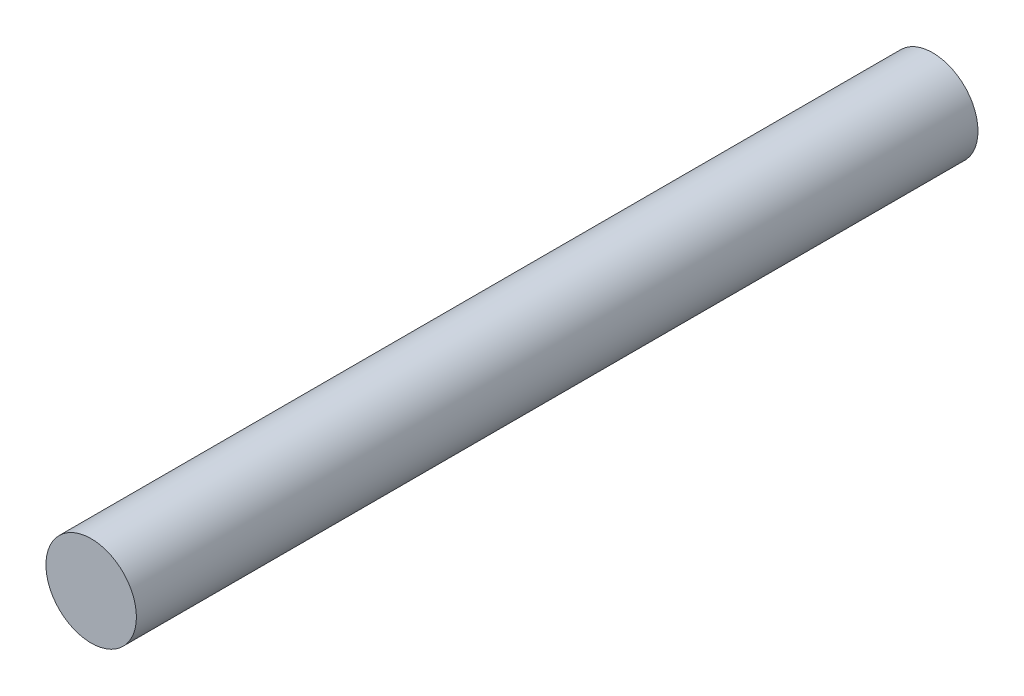
ISO-10303-21;
HEADER;
FILE_DESCRIPTION(('STEP AP214'),'2;1');
FILE_NAME('part.step','',(''),(''),'','','');
FILE_SCHEMA(('AUTOMOTIVE_DESIGN { 1 0 10303 214 1 1 1 1 }'));
ENDSEC;
DATA;
#1=APPLICATION_CONTEXT('core data for automotive mechanical design processes');
#2=APPLICATION_PROTOCOL_DEFINITION('international standard','automotive_design',2000,#1);
#3=PRODUCT_CONTEXT('',#1,'mechanical');
#4=PRODUCT('Part','Part','',(#3));
#5=PRODUCT_RELATED_PRODUCT_CATEGORY('part','',(#4));
#6=PRODUCT_DEFINITION_FORMATION('','',#4);
#7=PRODUCT_DEFINITION_CONTEXT('part definition',#1,'design');
#8=PRODUCT_DEFINITION('design','',#6,#7);
#9=PRODUCT_DEFINITION_SHAPE('','',#8);
#10=(LENGTH_UNIT() NAMED_UNIT(*) SI_UNIT(.MILLI.,.METRE.));
#11=(NAMED_UNIT(*) PLANE_ANGLE_UNIT() SI_UNIT($,.RADIAN.));
#12=(NAMED_UNIT(*) SI_UNIT($,.STERADIAN.) SOLID_ANGLE_UNIT());
#13=UNCERTAINTY_MEASURE_WITH_UNIT(LENGTH_MEASURE(1.E-05),#10,'distance_accuracy_value','');
#14=(GEOMETRIC_REPRESENTATION_CONTEXT(3) GLOBAL_UNCERTAINTY_ASSIGNED_CONTEXT((#13)) GLOBAL_UNIT_ASSIGNED_CONTEXT((#10,
#11,#12)) REPRESENTATION_CONTEXT('',''));
#15=CARTESIAN_POINT('',(0.,0.,0.));
#16=DIRECTION('',(0.,0.,1.));
#17=DIRECTION('',(1.,0.,0.));
#18=AXIS2_PLACEMENT_3D('',#15,#16,#17);
#19=CARTESIAN_POINT('',(0.,0.,46.5));
#20=DIRECTION('',(0.,0.,-1.));
#21=DIRECTION('',(-1.,0.,0.));
#22=AXIS2_PLACEMENT_3D('',#19,#20,#21);
#23=CYLINDRICAL_SURFACE('',#22,2.5);
#24=CARTESIAN_POINT('',(0.,0.,46.5));
#25=DIRECTION('',(0.,0.,1.));
#26=DIRECTION('',(1.,0.,0.));
#27=AXIS2_PLACEMENT_3D('',#24,#25,#26);
#28=CIRCLE('',#27,2.5);
#29=CARTESIAN_POINT('',(2.5,0.,46.5));
#30=VERTEX_POINT('',#29);
#31=EDGE_CURVE('E10',#30,#30,#28,.T.);
#32=ORIENTED_EDGE('',*,*,#31,.F.);
#33=EDGE_LOOP('',(#32));
#34=FACE_BOUND('',#33,.T.);
#35=CARTESIAN_POINT('',(0.,0.,0.));
#36=DIRECTION('',(0.,0.,1.));
#37=DIRECTION('',(1.,0.,0.));
#38=AXIS2_PLACEMENT_3D('',#35,#36,#37);
#39=CIRCLE('',#38,2.5);
#40=CARTESIAN_POINT('',(2.5,0.,0.));
#41=VERTEX_POINT('',#40);
#42=EDGE_CURVE('E44',#41,#41,#39,.T.);
#43=ORIENTED_EDGE('',*,*,#42,.T.);
#44=EDGE_LOOP('',(#43));
#45=FACE_BOUND('',#44,.T.);
#46=ADVANCED_FACE('F41',(#34,#45),#23,.T.);
#47=CARTESIAN_POINT('',(0.,0.,46.5));
#48=DIRECTION('',(0.,0.,1.));
#49=DIRECTION('',(1.,0.,0.));
#50=AXIS2_PLACEMENT_3D('',#47,#48,#49);
#51=PLANE('',#50);
#52=ORIENTED_EDGE('',*,*,#31,.T.);
#53=EDGE_LOOP('',(#52));
#54=FACE_BOUND('',#53,.T.);
#55=ADVANCED_FACE('F58',(#54),#51,.T.);
#56=CARTESIAN_POINT('',(0.,0.,0.));
#57=DIRECTION('',(0.,0.,1.));
#58=DIRECTION('',(1.,0.,0.));
#59=AXIS2_PLACEMENT_3D('',#56,#57,#58);
#60=PLANE('',#59);
#61=ORIENTED_EDGE('',*,*,#42,.F.);
#62=EDGE_LOOP('',(#61));
#63=FACE_BOUND('',#62,.T.);
#64=ADVANCED_FACE('F56',(#63),#60,.F.);
#65=CLOSED_SHELL('',(#46,#55,#64));
#66=MANIFOLD_SOLID_BREP('B2',#65);
#67=ADVANCED_BREP_SHAPE_REPRESENTATION('',(#18,#66),#14);
#68=SHAPE_DEFINITION_REPRESENTATION(#9,#67);
ENDSEC;
END-ISO-10303-21;
